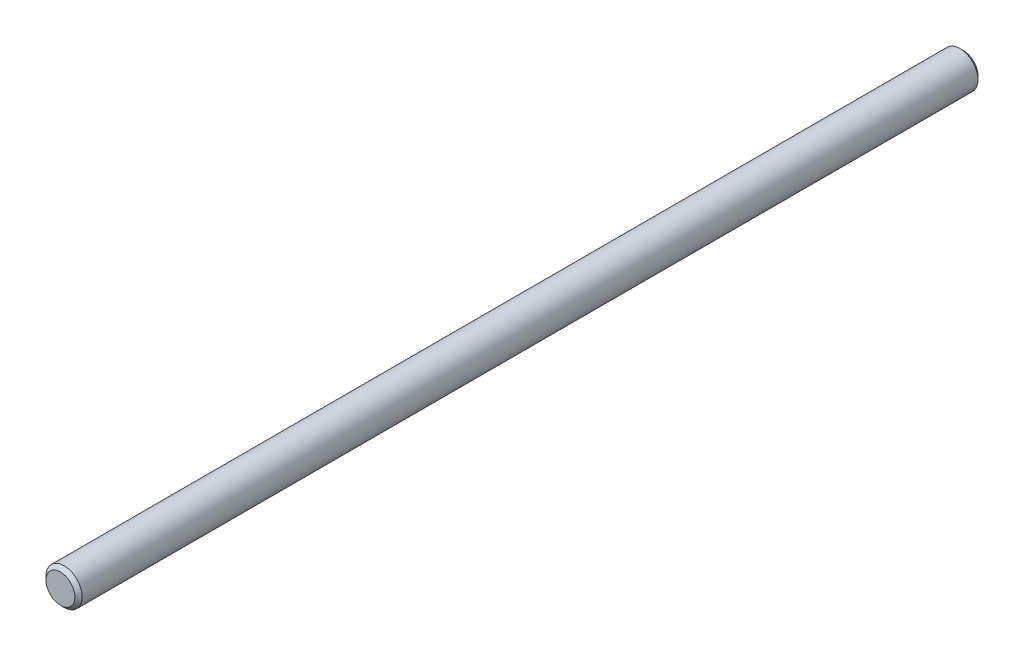
ISO-10303-21;
HEADER;
FILE_DESCRIPTION(('STEP AP214'),'2;1');
FILE_NAME('part.step','',(''),(''),'','','');
FILE_SCHEMA(('AUTOMOTIVE_DESIGN { 1 0 10303 214 1 1 1 1 }'));
ENDSEC;
DATA;
#1=APPLICATION_CONTEXT('core data for automotive mechanical design processes');
#2=APPLICATION_PROTOCOL_DEFINITION('international standard','automotive_design',2000,#1);
#3=PRODUCT_CONTEXT('',#1,'mechanical');
#4=PRODUCT('Part','Part','',(#3));
#5=PRODUCT_RELATED_PRODUCT_CATEGORY('part','',(#4));
#6=PRODUCT_DEFINITION_FORMATION('','',#4);
#7=PRODUCT_DEFINITION_CONTEXT('part definition',#1,'design');
#8=PRODUCT_DEFINITION('design','',#6,#7);
#9=PRODUCT_DEFINITION_SHAPE('','',#8);
#10=(LENGTH_UNIT() NAMED_UNIT(*) SI_UNIT(.MILLI.,.METRE.));
#11=(NAMED_UNIT(*) PLANE_ANGLE_UNIT() SI_UNIT($,.RADIAN.));
#12=(NAMED_UNIT(*) SI_UNIT($,.STERADIAN.) SOLID_ANGLE_UNIT());
#13=UNCERTAINTY_MEASURE_WITH_UNIT(LENGTH_MEASURE(1.E-05),#10,'distance_accuracy_value','');
#14=(GEOMETRIC_REPRESENTATION_CONTEXT(3) GLOBAL_UNCERTAINTY_ASSIGNED_CONTEXT((#13)) GLOBAL_UNIT_ASSIGNED_CONTEXT((#10,
#11,#12)) REPRESENTATION_CONTEXT('',''));
#15=CARTESIAN_POINT('',(0.,0.,0.));
#16=DIRECTION('',(0.,0.,1.));
#17=DIRECTION('',(1.,0.,0.));
#18=AXIS2_PLACEMENT_3D('',#15,#16,#17);
#19=CARTESIAN_POINT('',(0.,0.,125.));
#20=DIRECTION('',(0.,0.,-1.));
#21=DIRECTION('',(-1.,0.,0.));
#22=AXIS2_PLACEMENT_3D('',#19,#20,#21);
#23=CYLINDRICAL_SURFACE('',#22,5.);
#24=CARTESIAN_POINT('',(0.,0.,-124.));
#25=DIRECTION('',(0.,0.,1.));
#26=DIRECTION('',(1.,0.,0.));
#27=AXIS2_PLACEMENT_3D('',#24,#25,#26);
#28=CIRCLE('',#27,5.);
#29=CARTESIAN_POINT('',(5.,0.,-124.));
#30=VERTEX_POINT('',#29);
#31=EDGE_CURVE('E50',#30,#30,#28,.T.);
#32=ORIENTED_EDGE('',*,*,#31,.T.);
#33=EDGE_LOOP('',(#32));
#34=FACE_BOUND('',#33,.T.);
#35=CARTESIAN_POINT('',(0.,0.,124.));
#36=DIRECTION('',(0.,0.,1.));
#37=DIRECTION('',(1.,0.,0.));
#38=AXIS2_PLACEMENT_3D('',#35,#36,#37);
#39=CIRCLE('',#38,5.);
#40=CARTESIAN_POINT('',(5.,0.,124.));
#41=VERTEX_POINT('',#40);
#42=EDGE_CURVE('E55',#41,#41,#39,.F.);
#43=ORIENTED_EDGE('',*,*,#42,.T.);
#44=EDGE_LOOP('',(#43));
#45=FACE_BOUND('',#44,.T.);
#46=ADVANCED_FACE('F37',(#34,#45),#23,.T.);
#47=CARTESIAN_POINT('',(0.,0.,125.));
#48=DIRECTION('',(0.,0.,1.));
#49=DIRECTION('',(1.,0.,0.));
#50=AXIS2_PLACEMENT_3D('',#47,#48,#49);
#51=PLANE('',#50);
#52=CARTESIAN_POINT('',(0.,0.,125.));
#53=DIRECTION('',(0.,0.,1.));
#54=DIRECTION('',(1.,0.,0.));
#55=AXIS2_PLACEMENT_3D('',#52,#53,#54);
#56=CIRCLE('',#55,3.99999999999998);
#57=CARTESIAN_POINT('',(3.99999999999998,0.,125.));
#58=VERTEX_POINT('',#57);
#59=EDGE_CURVE('E10',#58,#58,#56,.T.);
#60=ORIENTED_EDGE('',*,*,#59,.T.);
#61=EDGE_LOOP('',(#60));
#62=FACE_BOUND('',#61,.T.);
#63=ADVANCED_FACE('F72',(#62),#51,.T.);
#64=CARTESIAN_POINT('',(0.,0.,-125.));
#65=DIRECTION('',(0.,0.,1.));
#66=DIRECTION('',(1.,0.,0.));
#67=AXIS2_PLACEMENT_3D('',#64,#65,#66);
#68=PLANE('',#67);
#69=CARTESIAN_POINT('',(0.,0.,-125.));
#70=DIRECTION('',(0.,0.,1.));
#71=DIRECTION('',(1.,0.,0.));
#72=AXIS2_PLACEMENT_3D('',#69,#70,#71);
#73=CIRCLE('',#72,4.00000000000003);
#74=CARTESIAN_POINT('',(4.00000000000003,0.,-125.));
#75=VERTEX_POINT('',#74);
#76=EDGE_CURVE('E45',#75,#75,#73,.F.);
#77=ORIENTED_EDGE('',*,*,#76,.T.);
#78=EDGE_LOOP('',(#77));
#79=FACE_BOUND('',#78,.T.);
#80=ADVANCED_FACE('F69',(#79),#68,.F.);
#81=CARTESIAN_POINT('',(0.,0.,-124.));
#82=DIRECTION('',(0.,0.,1.));
#83=DIRECTION('',(1.,0.,0.));
#84=AXIS2_PLACEMENT_3D('',#81,#82,#83);
#85=CONICAL_SURFACE('',#84,5.,0.78539816339746);
#86=ORIENTED_EDGE('',*,*,#76,.F.);
#87=EDGE_LOOP('',(#86));
#88=FACE_BOUND('',#87,.T.);
#89=ORIENTED_EDGE('',*,*,#31,.F.);
#90=EDGE_LOOP('',(#89));
#91=FACE_BOUND('',#90,.T.);
#92=ADVANCED_FACE('F65',(#88,#91),#85,.T.);
#93=CARTESIAN_POINT('',(0.,0.,125.));
#94=DIRECTION('',(0.,0.,-1.));
#95=DIRECTION('',(-1.,0.,0.));
#96=AXIS2_PLACEMENT_3D('',#93,#94,#95);
#97=CONICAL_SURFACE('',#96,3.99999999999998,0.785398163397453);
#98=ORIENTED_EDGE('',*,*,#42,.F.);
#99=EDGE_LOOP('',(#98));
#100=FACE_BOUND('',#99,.T.);
#101=ORIENTED_EDGE('',*,*,#59,.F.);
#102=EDGE_LOOP('',(#101));
#103=FACE_BOUND('',#102,.T.);
#104=ADVANCED_FACE('F39',(#100,#103),#97,.T.);
#105=CLOSED_SHELL('',(#46,#63,#80,#92,#104));
#106=MANIFOLD_SOLID_BREP('B2',#105);
#107=ADVANCED_BREP_SHAPE_REPRESENTATION('',(#18,#106),#14);
#108=SHAPE_DEFINITION_REPRESENTATION(#9,#107);
ENDSEC;
END-ISO-10303-21;
